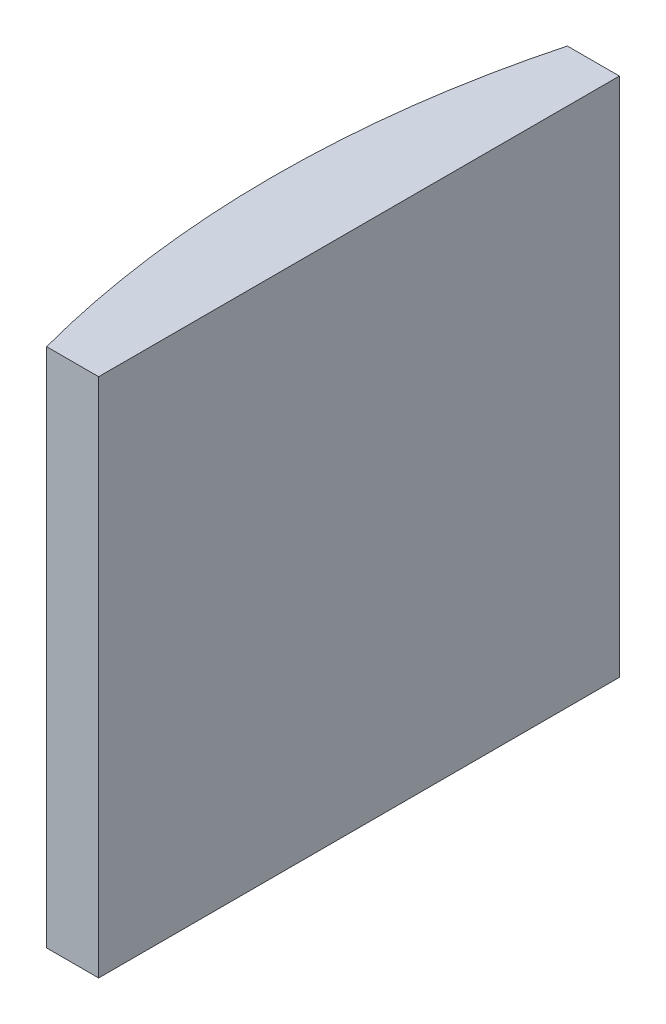
ISO-10303-21;
HEADER;
FILE_DESCRIPTION(('STEP AP214'),'2;1');
FILE_NAME('part.step','',(''),(''),'','','');
FILE_SCHEMA(('AUTOMOTIVE_DESIGN { 1 0 10303 214 1 1 1 1 }'));
ENDSEC;
DATA;
#1=APPLICATION_CONTEXT('core data for automotive mechanical design processes');
#2=APPLICATION_PROTOCOL_DEFINITION('international standard','automotive_design',2000,#1);
#3=PRODUCT_CONTEXT('',#1,'mechanical');
#4=PRODUCT('Part','Part','',(#3));
#5=PRODUCT_RELATED_PRODUCT_CATEGORY('part','',(#4));
#6=PRODUCT_DEFINITION_FORMATION('','',#4);
#7=PRODUCT_DEFINITION_CONTEXT('part definition',#1,'design');
#8=PRODUCT_DEFINITION('design','',#6,#7);
#9=PRODUCT_DEFINITION_SHAPE('','',#8);
#10=(LENGTH_UNIT() NAMED_UNIT(*) SI_UNIT(.MILLI.,.METRE.));
#11=(NAMED_UNIT(*) PLANE_ANGLE_UNIT() SI_UNIT($,.RADIAN.));
#12=(NAMED_UNIT(*) SI_UNIT($,.STERADIAN.) SOLID_ANGLE_UNIT());
#13=UNCERTAINTY_MEASURE_WITH_UNIT(LENGTH_MEASURE(1.E-05),#10,'distance_accuracy_value','');
#14=(GEOMETRIC_REPRESENTATION_CONTEXT(3) GLOBAL_UNCERTAINTY_ASSIGNED_CONTEXT((#13)) GLOBAL_UNIT_ASSIGNED_CONTEXT((#10,
#11,#12)) REPRESENTATION_CONTEXT('',''));
#15=CARTESIAN_POINT('',(0.,0.,0.));
#16=DIRECTION('',(0.,0.,1.));
#17=DIRECTION('',(1.,0.,0.));
#18=AXIS2_PLACEMENT_3D('',#15,#16,#17);
#19=CARTESIAN_POINT('',(4.35520433485127,20.,0.));
#20=DIRECTION('',(0.,-1.,0.));
#21=DIRECTION('',(0.,0.,-1.));
#22=AXIS2_PLACEMENT_3D('',#19,#20,#21);
#23=CYLINDRICAL_SURFACE('',#22,38.78);
#24=CARTESIAN_POINT('',(4.35520433485127,0.,0.));
#25=DIRECTION('',(0.,1.,0.));
#26=DIRECTION('',(0.,0.,1.));
#27=AXIS2_PLACEMENT_3D('',#24,#25,#26);
#28=CIRCLE('',#27,38.78);
#29=CARTESIAN_POINT('',(-33.1132944341146,0.,-10.));
#30=VERTEX_POINT('',#29);
#31=CARTESIAN_POINT('',(-33.1132944341146,0.,10.));
#32=VERTEX_POINT('',#31);
#33=EDGE_CURVE('E100',#30,#32,#28,.T.);
#34=ORIENTED_EDGE('',*,*,#33,.T.);
#35=DIRECTION('',(0.,-1.,0.));
#36=VECTOR('',#35,1.);
#37=CARTESIAN_POINT('',(-33.1132944341146,20.,10.));
#38=LINE('',#37,#36);
#39=CARTESIAN_POINT('',(-33.1132944341146,20.,10.));
#40=VERTEX_POINT('',#39);
#41=EDGE_CURVE('E11',#40,#32,#38,.T.);
#42=ORIENTED_EDGE('',*,*,#41,.F.);
#43=CARTESIAN_POINT('',(4.35520433485127,20.,0.));
#44=DIRECTION('',(0.,1.,0.));
#45=DIRECTION('',(0.,0.,1.));
#46=AXIS2_PLACEMENT_3D('',#43,#44,#45);
#47=CIRCLE('',#46,38.78);
#48=CARTESIAN_POINT('',(-33.1132944341146,20.,-10.));
#49=VERTEX_POINT('',#48);
#50=EDGE_CURVE('E88',#49,#40,#47,.T.);
#51=ORIENTED_EDGE('',*,*,#50,.F.);
#52=DIRECTION('',(0.,-1.,0.));
#53=VECTOR('',#52,1.);
#54=CARTESIAN_POINT('',(-33.1132944341146,20.,-10.));
#55=LINE('',#54,#53);
#56=EDGE_CURVE('E96',#49,#30,#55,.T.);
#57=ORIENTED_EDGE('',*,*,#56,.T.);
#58=EDGE_LOOP('',(#34,#42,#51,#57));
#59=FACE_BOUND('',#58,.T.);
#60=ADVANCED_FACE('F37',(#59),#23,.T.);
#61=CARTESIAN_POINT('',(-33.1132944341146,20.,10.));
#62=DIRECTION('',(0.,0.,-1.));
#63=DIRECTION('',(-1.,0.,0.));
#64=AXIS2_PLACEMENT_3D('',#61,#62,#63);
#65=PLANE('',#64);
#66=DIRECTION('',(1.,0.,0.));
#67=VECTOR('',#66,1.);
#68=CARTESIAN_POINT('',(-33.1132944341146,0.,10.));
#69=LINE('',#68,#67);
#70=CARTESIAN_POINT('',(-31.1147956651487,0.,10.));
#71=VERTEX_POINT('',#70);
#72=EDGE_CURVE('E92',#32,#71,#69,.T.);
#73=ORIENTED_EDGE('',*,*,#72,.T.);
#74=DIRECTION('',(0.,-1.,0.));
#75=VECTOR('',#74,1.);
#76=CARTESIAN_POINT('',(-31.1147956651487,20.,10.));
#77=LINE('',#76,#75);
#78=CARTESIAN_POINT('',(-31.1147956651487,20.,10.));
#79=VERTEX_POINT('',#78);
#80=EDGE_CURVE('E45',#79,#71,#77,.T.);
#81=ORIENTED_EDGE('',*,*,#80,.F.);
#82=DIRECTION('',(1.,0.,0.));
#83=VECTOR('',#82,1.);
#84=CARTESIAN_POINT('',(-33.1132944341146,20.,10.));
#85=LINE('',#84,#83);
#86=EDGE_CURVE('E83',#40,#79,#85,.T.);
#87=ORIENTED_EDGE('',*,*,#86,.F.);
#88=ORIENTED_EDGE('',*,*,#41,.T.);
#89=EDGE_LOOP('',(#73,#81,#87,#88));
#90=FACE_BOUND('',#89,.T.);
#91=ADVANCED_FACE('F91',(#90),#65,.F.);
#92=CARTESIAN_POINT('',(-31.1147956651487,20.,-9.99999999999999));
#93=DIRECTION('',(-1.,0.,0.));
#94=DIRECTION('',(0.,0.,1.));
#95=AXIS2_PLACEMENT_3D('',#92,#93,#94);
#96=PLANE('',#95);
#97=DIRECTION('',(0.,0.,-1.));
#98=VECTOR('',#97,1.);
#99=CARTESIAN_POINT('',(-31.1147956651487,0.,-9.99999999999999));
#100=LINE('',#99,#98);
#101=CARTESIAN_POINT('',(-31.1147956651487,0.,-9.99999999999999));
#102=VERTEX_POINT('',#101);
#103=EDGE_CURVE('E70',#71,#102,#100,.T.);
#104=ORIENTED_EDGE('',*,*,#103,.T.);
#105=DIRECTION('',(0.,-1.,0.));
#106=VECTOR('',#105,1.);
#107=CARTESIAN_POINT('',(-31.1147956651487,20.,-9.99999999999999));
#108=LINE('',#107,#106);
#109=CARTESIAN_POINT('',(-31.1147956651487,20.,-9.99999999999999));
#110=VERTEX_POINT('',#109);
#111=EDGE_CURVE('E93',#110,#102,#108,.T.);
#112=ORIENTED_EDGE('',*,*,#111,.F.);
#113=DIRECTION('',(0.,0.,-1.));
#114=VECTOR('',#113,1.);
#115=CARTESIAN_POINT('',(-31.1147956651487,20.,-9.99999999999999));
#116=LINE('',#115,#114);
#117=EDGE_CURVE('E86',#79,#110,#116,.T.);
#118=ORIENTED_EDGE('',*,*,#117,.F.);
#119=ORIENTED_EDGE('',*,*,#80,.T.);
#120=EDGE_LOOP('',(#104,#112,#118,#119));
#121=FACE_BOUND('',#120,.T.);
#122=ADVANCED_FACE('F94',(#121),#96,.F.);
#123=CARTESIAN_POINT('',(-33.1132944341146,20.,-10.));
#124=DIRECTION('',(0.,0.,1.));
#125=DIRECTION('',(1.,0.,0.));
#126=AXIS2_PLACEMENT_3D('',#123,#124,#125);
#127=PLANE('',#126);
#128=DIRECTION('',(-1.,0.,0.));
#129=VECTOR('',#128,1.);
#130=CARTESIAN_POINT('',(-33.1132944341146,0.,-10.));
#131=LINE('',#130,#129);
#132=EDGE_CURVE('E76',#102,#30,#131,.T.);
#133=ORIENTED_EDGE('',*,*,#132,.T.);
#134=ORIENTED_EDGE('',*,*,#56,.F.);
#135=DIRECTION('',(-1.,0.,0.));
#136=VECTOR('',#135,1.);
#137=CARTESIAN_POINT('',(-33.1132944341146,20.,-10.));
#138=LINE('',#137,#136);
#139=EDGE_CURVE('E53',#110,#49,#138,.T.);
#140=ORIENTED_EDGE('',*,*,#139,.F.);
#141=ORIENTED_EDGE('',*,*,#111,.T.);
#142=EDGE_LOOP('',(#133,#134,#140,#141));
#143=FACE_BOUND('',#142,.T.);
#144=ADVANCED_FACE('F107',(#143),#127,.F.);
#145=CARTESIAN_POINT('',(4.35520433485127,20.,0.));
#146=DIRECTION('',(0.,1.,0.));
#147=DIRECTION('',(0.,0.,1.));
#148=AXIS2_PLACEMENT_3D('',#145,#146,#147);
#149=PLANE('',#148);
#150=ORIENTED_EDGE('',*,*,#50,.T.);
#151=ORIENTED_EDGE('',*,*,#86,.T.);
#152=ORIENTED_EDGE('',*,*,#117,.T.);
#153=ORIENTED_EDGE('',*,*,#139,.T.);
#154=EDGE_LOOP('',(#150,#151,#152,#153));
#155=FACE_BOUND('',#154,.T.);
#156=ADVANCED_FACE('F84',(#155),#149,.T.);
#157=CARTESIAN_POINT('',(4.35520433485127,0.,0.));
#158=DIRECTION('',(0.,1.,0.));
#159=DIRECTION('',(0.,0.,1.));
#160=AXIS2_PLACEMENT_3D('',#157,#158,#159);
#161=PLANE('',#160);
#162=ORIENTED_EDGE('',*,*,#33,.F.);
#163=ORIENTED_EDGE('',*,*,#132,.F.);
#164=ORIENTED_EDGE('',*,*,#103,.F.);
#165=ORIENTED_EDGE('',*,*,#72,.F.);
#166=EDGE_LOOP('',(#162,#163,#164,#165));
#167=FACE_BOUND('',#166,.T.);
#168=ADVANCED_FACE('F110',(#167),#161,.F.);
#169=CLOSED_SHELL('',(#60,#91,#122,#144,#156,#168));
#170=MANIFOLD_SOLID_BREP('B2',#169);
#171=ADVANCED_BREP_SHAPE_REPRESENTATION('',(#18,#170),#14);
#172=SHAPE_DEFINITION_REPRESENTATION(#9,#171);
ENDSEC;
END-ISO-10303-21;
